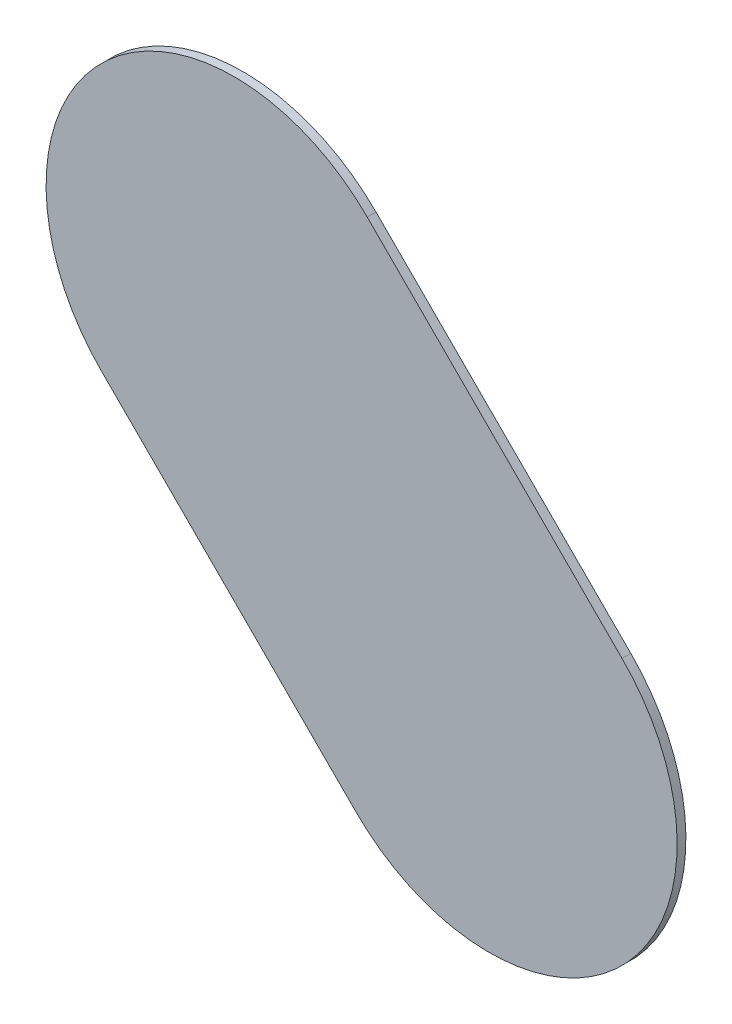
ISO-10303-21;
HEADER;
FILE_DESCRIPTION(('STEP AP214'),'2;1');
FILE_NAME('part.step','',(''),(''),'','','');
FILE_SCHEMA(('AUTOMOTIVE_DESIGN { 1 0 10303 214 1 1 1 1 }'));
ENDSEC;
DATA;
#1=APPLICATION_CONTEXT('core data for automotive mechanical design processes');
#2=APPLICATION_PROTOCOL_DEFINITION('international standard','automotive_design',2000,#1);
#3=PRODUCT_CONTEXT('',#1,'mechanical');
#4=PRODUCT('Part','Part','',(#3));
#5=PRODUCT_RELATED_PRODUCT_CATEGORY('part','',(#4));
#6=PRODUCT_DEFINITION_FORMATION('','',#4);
#7=PRODUCT_DEFINITION_CONTEXT('part definition',#1,'design');
#8=PRODUCT_DEFINITION('design','',#6,#7);
#9=PRODUCT_DEFINITION_SHAPE('','',#8);
#10=(LENGTH_UNIT() NAMED_UNIT(*) SI_UNIT(.MILLI.,.METRE.));
#11=(NAMED_UNIT(*) PLANE_ANGLE_UNIT() SI_UNIT($,.RADIAN.));
#12=(NAMED_UNIT(*) SI_UNIT($,.STERADIAN.) SOLID_ANGLE_UNIT());
#13=UNCERTAINTY_MEASURE_WITH_UNIT(LENGTH_MEASURE(1.E-05),#10,'distance_accuracy_value','');
#14=(GEOMETRIC_REPRESENTATION_CONTEXT(3) GLOBAL_UNCERTAINTY_ASSIGNED_CONTEXT((#13)) GLOBAL_UNIT_ASSIGNED_CONTEXT((#10,
#11,#12)) REPRESENTATION_CONTEXT('',''));
#15=CARTESIAN_POINT('',(0.,0.,0.));
#16=DIRECTION('',(0.,0.,1.));
#17=DIRECTION('',(1.,0.,0.));
#18=AXIS2_PLACEMENT_3D('',#15,#16,#17);
#19=CARTESIAN_POINT('',(127.65733,-118.849669,0.));
#20=DIRECTION('',(0.,0.,1.));
#21=DIRECTION('',(1.,0.,0.));
#22=AXIS2_PLACEMENT_3D('',#19,#20,#21);
#23=PLANE('',#22);
#24=DIRECTION('',(-0.707106781186548,0.707106781186548,0.));
#25=VECTOR('',#24,1.);
#26=CARTESIAN_POINT('',(127.65733,-118.849669,0.));
#27=LINE('',#26,#25);
#28=CARTESIAN_POINT('',(127.65733,-118.849669,0.));
#29=VERTEX_POINT('',#28);
#30=CARTESIAN_POINT('',(126.64133,-117.833669,0.));
#31=VERTEX_POINT('',#30);
#32=EDGE_CURVE('E83',#29,#31,#27,.T.);
#33=ORIENTED_EDGE('',*,*,#32,.T.);
#34=CARTESIAN_POINT('',(126.1109995,-118.3639995,0.));
#35=DIRECTION('',(0.,0.,1.));
#36=DIRECTION('',(0.707106781186548,0.707106781186548,0.));
#37=AXIS2_PLACEMENT_3D('',#34,#35,#36);
#38=CIRCLE('',#37,0.75000058564);
#39=CARTESIAN_POINT('',(125.580669,-118.89433,0.));
#40=VERTEX_POINT('',#39);
#41=EDGE_CURVE('E105',#31,#40,#38,.T.);
#42=ORIENTED_EDGE('',*,*,#41,.T.);
#43=DIRECTION('',(0.707106781186548,-0.707106781186548,0.));
#44=VECTOR('',#43,1.);
#45=CARTESIAN_POINT('',(125.580669,-118.89433,0.));
#46=LINE('',#45,#44);
#47=CARTESIAN_POINT('',(126.596669,-119.91033,0.));
#48=VERTEX_POINT('',#47);
#49=EDGE_CURVE('E75',#40,#48,#46,.T.);
#50=ORIENTED_EDGE('',*,*,#49,.T.);
#51=CARTESIAN_POINT('',(127.1269995,-119.3799995,0.));
#52=DIRECTION('',(0.,0.,1.));
#53=DIRECTION('',(-0.707106781186548,-0.707106781186548,0.));
#54=AXIS2_PLACEMENT_3D('',#51,#52,#53);
#55=CIRCLE('',#54,0.75000058564);
#56=EDGE_CURVE('E11',#48,#29,#55,.T.);
#57=ORIENTED_EDGE('',*,*,#56,.T.);
#58=EDGE_LOOP('',(#33,#42,#50,#57));
#59=FACE_BOUND('',#58,.T.);
#60=ADVANCED_FACE('F17',(#59),#23,.T.);
#61=CARTESIAN_POINT('',(127.65733,-118.849669,-0.035));
#62=DIRECTION('',(0.,0.,1.));
#63=DIRECTION('',(1.,0.,0.));
#64=AXIS2_PLACEMENT_3D('',#61,#62,#63);
#65=PLANE('',#64);
#66=CARTESIAN_POINT('',(127.1269995,-119.3799995,-0.035));
#67=DIRECTION('',(0.,0.,1.));
#68=DIRECTION('',(-0.707106781186548,-0.707106781186548,0.));
#69=AXIS2_PLACEMENT_3D('',#66,#67,#68);
#70=CIRCLE('',#69,0.75000058564);
#71=CARTESIAN_POINT('',(126.596669,-119.91033,-0.035));
#72=VERTEX_POINT('',#71);
#73=CARTESIAN_POINT('',(127.65733,-118.849669,-0.035));
#74=VERTEX_POINT('',#73);
#75=EDGE_CURVE('E26',#72,#74,#70,.T.);
#76=ORIENTED_EDGE('',*,*,#75,.F.);
#77=DIRECTION('',(0.707106781186548,-0.707106781186548,0.));
#78=VECTOR('',#77,1.);
#79=CARTESIAN_POINT('',(125.580669,-118.89433,-0.035));
#80=LINE('',#79,#78);
#81=CARTESIAN_POINT('',(125.580669,-118.89433,-0.035));
#82=VERTEX_POINT('',#81);
#83=EDGE_CURVE('E102',#82,#72,#80,.T.);
#84=ORIENTED_EDGE('',*,*,#83,.F.);
#85=CARTESIAN_POINT('',(126.1109995,-118.3639995,-0.035));
#86=DIRECTION('',(0.,0.,1.));
#87=DIRECTION('',(0.707106781186548,0.707106781186548,0.));
#88=AXIS2_PLACEMENT_3D('',#85,#86,#87);
#89=CIRCLE('',#88,0.75000058564);
#90=CARTESIAN_POINT('',(126.64133,-117.833669,-0.035));
#91=VERTEX_POINT('',#90);
#92=EDGE_CURVE('E85',#91,#82,#89,.T.);
#93=ORIENTED_EDGE('',*,*,#92,.F.);
#94=DIRECTION('',(-0.707106781186548,0.707106781186548,0.));
#95=VECTOR('',#94,1.);
#96=CARTESIAN_POINT('',(127.65733,-118.849669,-0.035));
#97=LINE('',#96,#95);
#98=EDGE_CURVE('E81',#74,#91,#97,.T.);
#99=ORIENTED_EDGE('',*,*,#98,.F.);
#100=EDGE_LOOP('',(#76,#84,#93,#99));
#101=FACE_BOUND('',#100,.T.);
#102=ADVANCED_FACE('F87',(#101),#65,.F.);
#103=CARTESIAN_POINT('',(127.1269995,-119.3799995,-0.035));
#104=DIRECTION('',(0.,0.,-1.));
#105=DIRECTION('',(-0.707106781186548,-0.707106781186548,0.));
#106=AXIS2_PLACEMENT_3D('',#103,#104,#105);
#107=CYLINDRICAL_SURFACE('',#106,0.75000058564);
#108=ORIENTED_EDGE('',*,*,#75,.T.);
#109=DIRECTION('',(0.,0.,1.));
#110=VECTOR('',#109,1.);
#111=CARTESIAN_POINT('',(127.65733,-118.849669,-0.035));
#112=LINE('',#111,#110);
#113=EDGE_CURVE('E70',#74,#29,#112,.T.);
#114=ORIENTED_EDGE('',*,*,#113,.T.);
#115=ORIENTED_EDGE('',*,*,#56,.F.);
#116=DIRECTION('',(0.,0.,1.));
#117=VECTOR('',#116,1.);
#118=CARTESIAN_POINT('',(126.596669,-119.91033,-0.035));
#119=LINE('',#118,#117);
#120=EDGE_CURVE('E20',#72,#48,#119,.T.);
#121=ORIENTED_EDGE('',*,*,#120,.F.);
#122=EDGE_LOOP('',(#108,#114,#115,#121));
#123=FACE_BOUND('',#122,.T.);
#124=ADVANCED_FACE('F69',(#123),#107,.T.);
#125=CARTESIAN_POINT('',(125.580669,-118.89433,-0.035));
#126=DIRECTION('',(0.707106781186548,0.707106781186548,0.));
#127=DIRECTION('',(0.,0.,-1.));
#128=AXIS2_PLACEMENT_3D('',#125,#126,#127);
#129=PLANE('',#128);
#130=ORIENTED_EDGE('',*,*,#83,.T.);
#131=ORIENTED_EDGE('',*,*,#120,.T.);
#132=ORIENTED_EDGE('',*,*,#49,.F.);
#133=DIRECTION('',(0.,0.,1.));
#134=VECTOR('',#133,1.);
#135=CARTESIAN_POINT('',(125.580669,-118.89433,-0.035));
#136=LINE('',#135,#134);
#137=EDGE_CURVE('E107',#82,#40,#136,.T.);
#138=ORIENTED_EDGE('',*,*,#137,.F.);
#139=EDGE_LOOP('',(#130,#131,#132,#138));
#140=FACE_BOUND('',#139,.T.);
#141=ADVANCED_FACE('F120',(#140),#129,.F.);
#142=CARTESIAN_POINT('',(126.1109995,-118.3639995,-0.035));
#143=DIRECTION('',(0.,0.,-1.));
#144=DIRECTION('',(0.707106781186548,0.707106781186548,0.));
#145=AXIS2_PLACEMENT_3D('',#142,#143,#144);
#146=CYLINDRICAL_SURFACE('',#145,0.75000058564);
#147=ORIENTED_EDGE('',*,*,#92,.T.);
#148=ORIENTED_EDGE('',*,*,#137,.T.);
#149=ORIENTED_EDGE('',*,*,#41,.F.);
#150=DIRECTION('',(0.,0.,1.));
#151=VECTOR('',#150,1.);
#152=CARTESIAN_POINT('',(126.64133,-117.833669,-0.035));
#153=LINE('',#152,#151);
#154=EDGE_CURVE('E91',#91,#31,#153,.T.);
#155=ORIENTED_EDGE('',*,*,#154,.F.);
#156=EDGE_LOOP('',(#147,#148,#149,#155));
#157=FACE_BOUND('',#156,.T.);
#158=ADVANCED_FACE('F118',(#157),#146,.T.);
#159=CARTESIAN_POINT('',(127.65733,-118.849669,-0.035));
#160=DIRECTION('',(-0.707106781186548,-0.707106781186548,0.));
#161=DIRECTION('',(-0.707106781186548,0.707106781186548,0.));
#162=AXIS2_PLACEMENT_3D('',#159,#160,#161);
#163=PLANE('',#162);
#164=ORIENTED_EDGE('',*,*,#98,.T.);
#165=ORIENTED_EDGE('',*,*,#154,.T.);
#166=ORIENTED_EDGE('',*,*,#32,.F.);
#167=ORIENTED_EDGE('',*,*,#113,.F.);
#168=EDGE_LOOP('',(#164,#165,#166,#167));
#169=FACE_BOUND('',#168,.T.);
#170=ADVANCED_FACE('F79',(#169),#163,.F.);
#171=CLOSED_SHELL('',(#60,#102,#124,#141,#158,#170));
#172=MANIFOLD_SOLID_BREP('B1',#171);
#173=ADVANCED_BREP_SHAPE_REPRESENTATION('',(#18,#172),#14);
#174=SHAPE_DEFINITION_REPRESENTATION(#9,#173);
ENDSEC;
END-ISO-10303-21;
